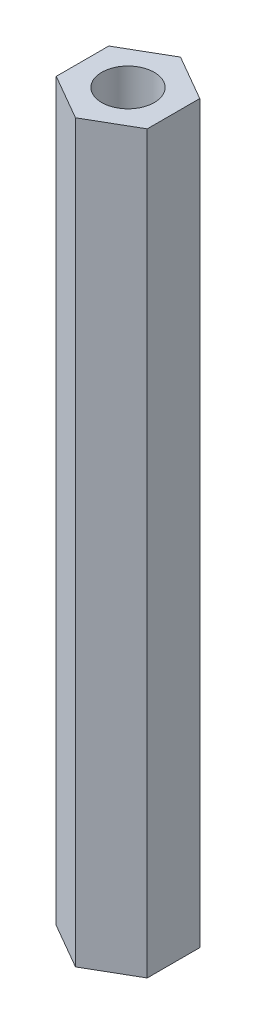
ISO-10303-21;
HEADER;
FILE_DESCRIPTION(('STEP AP214'),'2;1');
FILE_NAME('part.step','',(''),(''),'','','');
FILE_SCHEMA(('AUTOMOTIVE_DESIGN { 1 0 10303 214 1 1 1 1 }'));
ENDSEC;
DATA;
#1=APPLICATION_CONTEXT('core data for automotive mechanical design processes');
#2=APPLICATION_PROTOCOL_DEFINITION('international standard','automotive_design',2000,#1);
#3=PRODUCT_CONTEXT('',#1,'mechanical');
#4=PRODUCT('Part','Part','',(#3));
#5=PRODUCT_RELATED_PRODUCT_CATEGORY('part','',(#4));
#6=PRODUCT_DEFINITION_FORMATION('','',#4);
#7=PRODUCT_DEFINITION_CONTEXT('part definition',#1,'design');
#8=PRODUCT_DEFINITION('design','',#6,#7);
#9=PRODUCT_DEFINITION_SHAPE('','',#8);
#10=(LENGTH_UNIT() NAMED_UNIT(*) SI_UNIT(.MILLI.,.METRE.));
#11=(NAMED_UNIT(*) PLANE_ANGLE_UNIT() SI_UNIT($,.RADIAN.));
#12=(NAMED_UNIT(*) SI_UNIT($,.STERADIAN.) SOLID_ANGLE_UNIT());
#13=UNCERTAINTY_MEASURE_WITH_UNIT(LENGTH_MEASURE(1.E-05),#10,'distance_accuracy_value','');
#14=(GEOMETRIC_REPRESENTATION_CONTEXT(3) GLOBAL_UNCERTAINTY_ASSIGNED_CONTEXT((#13)) GLOBAL_UNIT_ASSIGNED_CONTEXT((#10,
#11,#12)) REPRESENTATION_CONTEXT('',''));
#15=CARTESIAN_POINT('',(0.,0.,0.));
#16=DIRECTION('',(0.,0.,1.));
#17=DIRECTION('',(1.,0.,0.));
#18=AXIS2_PLACEMENT_3D('',#15,#16,#17);
#19=CARTESIAN_POINT('',(0.,70.,-5.));
#20=DIRECTION('',(0.,1.,0.));
#21=DIRECTION('',(0.,0.,1.));
#22=AXIS2_PLACEMENT_3D('',#19,#20,#21);
#23=PLANE('',#22);
#24=DIRECTION('',(-0.866025403784439,0.,-0.5));
#25=VECTOR('',#24,1.);
#26=CARTESIAN_POINT('',(4.33012701892219,70.,-2.5));
#27=LINE('',#26,#25);
#28=CARTESIAN_POINT('',(4.33012701892219,70.,-2.5));
#29=VERTEX_POINT('',#28);
#30=CARTESIAN_POINT('',(0.,70.,-5.));
#31=VERTEX_POINT('',#30);
#32=EDGE_CURVE('E129',#29,#31,#27,.T.);
#33=ORIENTED_EDGE('',*,*,#32,.T.);
#34=DIRECTION('',(-0.866025403784439,0.,0.5));
#35=VECTOR('',#34,1.);
#36=CARTESIAN_POINT('',(0.,70.,-5.));
#37=LINE('',#36,#35);
#38=CARTESIAN_POINT('',(-4.33012701892219,70.,-2.5));
#39=VERTEX_POINT('',#38);
#40=EDGE_CURVE('E87',#31,#39,#37,.T.);
#41=ORIENTED_EDGE('',*,*,#40,.T.);
#42=DIRECTION('',(0.,0.,1.));
#43=VECTOR('',#42,1.);
#44=CARTESIAN_POINT('',(-4.33012701892219,70.,-2.5));
#45=LINE('',#44,#43);
#46=CARTESIAN_POINT('',(-4.33012701892219,70.,2.5));
#47=VERTEX_POINT('',#46);
#48=EDGE_CURVE('E100',#39,#47,#45,.T.);
#49=ORIENTED_EDGE('',*,*,#48,.T.);
#50=DIRECTION('',(0.866025403784439,0.,0.5));
#51=VECTOR('',#50,1.);
#52=CARTESIAN_POINT('',(-4.33012701892219,70.,2.5));
#53=LINE('',#52,#51);
#54=CARTESIAN_POINT('',(0.,70.,5.));
#55=VERTEX_POINT('',#54);
#56=EDGE_CURVE('E94',#47,#55,#53,.T.);
#57=ORIENTED_EDGE('',*,*,#56,.T.);
#58=DIRECTION('',(0.866025403784439,0.,-0.5));
#59=VECTOR('',#58,1.);
#60=CARTESIAN_POINT('',(0.,70.,5.));
#61=LINE('',#60,#59);
#62=CARTESIAN_POINT('',(4.33012701892219,70.,2.5));
#63=VERTEX_POINT('',#62);
#64=EDGE_CURVE('E98',#55,#63,#61,.T.);
#65=ORIENTED_EDGE('',*,*,#64,.T.);
#66=DIRECTION('',(0.,0.,-1.));
#67=VECTOR('',#66,1.);
#68=CARTESIAN_POINT('',(4.33012701892219,70.,2.5));
#69=LINE('',#68,#67);
#70=EDGE_CURVE('E50',#63,#29,#69,.T.);
#71=ORIENTED_EDGE('',*,*,#70,.T.);
#72=EDGE_LOOP('',(#33,#41,#49,#57,#65,#71));
#73=FACE_BOUND('',#72,.T.);
#74=CARTESIAN_POINT('',(0.,70.,0.));
#75=DIRECTION('',(0.,1.,0.));
#76=DIRECTION('',(0.,0.,1.));
#77=AXIS2_PLACEMENT_3D('',#74,#75,#76);
#78=CIRCLE('',#77,2.5);
#79=CARTESIAN_POINT('',(0.,70.,2.5));
#80=VERTEX_POINT('',#79);
#81=EDGE_CURVE('E122',#80,#80,#78,.T.);
#82=ORIENTED_EDGE('',*,*,#81,.F.);
#83=EDGE_LOOP('',(#82));
#84=FACE_BOUND('',#83,.T.);
#85=ADVANCED_FACE('F33',(#73,#84),#23,.T.);
#86=CARTESIAN_POINT('',(0.,0.,-5.));
#87=DIRECTION('',(0.,1.,0.));
#88=DIRECTION('',(0.,0.,1.));
#89=AXIS2_PLACEMENT_3D('',#86,#87,#88);
#90=PLANE('',#89);
#91=DIRECTION('',(-0.866025403784439,0.,-0.5));
#92=VECTOR('',#91,1.);
#93=CARTESIAN_POINT('',(4.33012701892219,0.,-2.5));
#94=LINE('',#93,#92);
#95=CARTESIAN_POINT('',(4.33012701892219,0.,-2.5));
#96=VERTEX_POINT('',#95);
#97=CARTESIAN_POINT('',(0.,0.,-5.));
#98=VERTEX_POINT('',#97);
#99=EDGE_CURVE('E118',#96,#98,#94,.T.);
#100=ORIENTED_EDGE('',*,*,#99,.F.);
#101=DIRECTION('',(0.,0.,-1.));
#102=VECTOR('',#101,1.);
#103=CARTESIAN_POINT('',(4.33012701892219,0.,2.5));
#104=LINE('',#103,#102);
#105=CARTESIAN_POINT('',(4.33012701892219,0.,2.5));
#106=VERTEX_POINT('',#105);
#107=EDGE_CURVE('E79',#106,#96,#104,.T.);
#108=ORIENTED_EDGE('',*,*,#107,.F.);
#109=DIRECTION('',(0.866025403784439,0.,-0.5));
#110=VECTOR('',#109,1.);
#111=CARTESIAN_POINT('',(0.,0.,5.));
#112=LINE('',#111,#110);
#113=CARTESIAN_POINT('',(0.,0.,5.));
#114=VERTEX_POINT('',#113);
#115=EDGE_CURVE('E73',#114,#106,#112,.T.);
#116=ORIENTED_EDGE('',*,*,#115,.F.);
#117=DIRECTION('',(0.866025403784439,0.,0.5));
#118=VECTOR('',#117,1.);
#119=CARTESIAN_POINT('',(-4.33012701892219,0.,2.5));
#120=LINE('',#119,#118);
#121=CARTESIAN_POINT('',(-4.33012701892219,0.,2.5));
#122=VERTEX_POINT('',#121);
#123=EDGE_CURVE('E108',#122,#114,#120,.T.);
#124=ORIENTED_EDGE('',*,*,#123,.F.);
#125=DIRECTION('',(0.,0.,1.));
#126=VECTOR('',#125,1.);
#127=CARTESIAN_POINT('',(-4.33012701892219,0.,-2.5));
#128=LINE('',#127,#126);
#129=CARTESIAN_POINT('',(-4.33012701892219,0.,-2.5));
#130=VERTEX_POINT('',#129);
#131=EDGE_CURVE('E124',#130,#122,#128,.T.);
#132=ORIENTED_EDGE('',*,*,#131,.F.);
#133=DIRECTION('',(-0.866025403784439,0.,0.5));
#134=VECTOR('',#133,1.);
#135=CARTESIAN_POINT('',(0.,0.,-5.));
#136=LINE('',#135,#134);
#137=EDGE_CURVE('E121',#98,#130,#136,.T.);
#138=ORIENTED_EDGE('',*,*,#137,.F.);
#139=EDGE_LOOP('',(#100,#108,#116,#124,#132,#138));
#140=FACE_BOUND('',#139,.T.);
#141=CARTESIAN_POINT('',(0.,0.,0.));
#142=DIRECTION('',(0.,1.,0.));
#143=DIRECTION('',(0.,0.,1.));
#144=AXIS2_PLACEMENT_3D('',#141,#142,#143);
#145=CIRCLE('',#144,2.5);
#146=CARTESIAN_POINT('',(0.,0.,2.5));
#147=VERTEX_POINT('',#146);
#148=EDGE_CURVE('E222',#147,#147,#145,.T.);
#149=ORIENTED_EDGE('',*,*,#148,.T.);
#150=EDGE_LOOP('',(#149));
#151=FACE_BOUND('',#150,.T.);
#152=ADVANCED_FACE('F138',(#140,#151),#90,.F.);
#153=CARTESIAN_POINT('',(4.33012701892219,70.,-2.5));
#154=DIRECTION('',(-0.5,0.,0.866025403784439));
#155=DIRECTION('',(0.866025403784439,0.,0.5));
#156=AXIS2_PLACEMENT_3D('',#153,#154,#155);
#157=PLANE('',#156);
#158=ORIENTED_EDGE('',*,*,#99,.T.);
#159=DIRECTION('',(0.,-1.,0.));
#160=VECTOR('',#159,1.);
#161=CARTESIAN_POINT('',(0.,70.,-5.));
#162=LINE('',#161,#160);
#163=EDGE_CURVE('E11',#31,#98,#162,.T.);
#164=ORIENTED_EDGE('',*,*,#163,.F.);
#165=ORIENTED_EDGE('',*,*,#32,.F.);
#166=DIRECTION('',(0.,-1.,0.));
#167=VECTOR('',#166,1.);
#168=CARTESIAN_POINT('',(4.33012701892219,70.,-2.5));
#169=LINE('',#168,#167);
#170=EDGE_CURVE('E114',#29,#96,#169,.T.);
#171=ORIENTED_EDGE('',*,*,#170,.T.);
#172=EDGE_LOOP('',(#158,#164,#165,#171));
#173=FACE_BOUND('',#172,.T.);
#174=ADVANCED_FACE('F35',(#173),#157,.F.);
#175=CARTESIAN_POINT('',(0.,70.,-5.));
#176=DIRECTION('',(0.5,0.,0.866025403784439));
#177=DIRECTION('',(0.866025403784439,0.,-0.5));
#178=AXIS2_PLACEMENT_3D('',#175,#176,#177);
#179=PLANE('',#178);
#180=ORIENTED_EDGE('',*,*,#137,.T.);
#181=DIRECTION('',(0.,-1.,0.));
#182=VECTOR('',#181,1.);
#183=CARTESIAN_POINT('',(-4.33012701892219,70.,-2.5));
#184=LINE('',#183,#182);
#185=EDGE_CURVE('E42',#39,#130,#184,.T.);
#186=ORIENTED_EDGE('',*,*,#185,.F.);
#187=ORIENTED_EDGE('',*,*,#40,.F.);
#188=ORIENTED_EDGE('',*,*,#163,.T.);
#189=EDGE_LOOP('',(#180,#186,#187,#188));
#190=FACE_BOUND('',#189,.T.);
#191=ADVANCED_FACE('F163',(#190),#179,.F.);
#192=CARTESIAN_POINT('',(-4.33012701892219,70.,-2.5));
#193=DIRECTION('',(1.,0.,0.));
#194=DIRECTION('',(0.,0.,-1.));
#195=AXIS2_PLACEMENT_3D('',#192,#193,#194);
#196=PLANE('',#195);
#197=ORIENTED_EDGE('',*,*,#131,.T.);
#198=DIRECTION('',(0.,-1.,0.));
#199=VECTOR('',#198,1.);
#200=CARTESIAN_POINT('',(-4.33012701892219,70.,2.5));
#201=LINE('',#200,#199);
#202=EDGE_CURVE('E109',#47,#122,#201,.T.);
#203=ORIENTED_EDGE('',*,*,#202,.F.);
#204=ORIENTED_EDGE('',*,*,#48,.F.);
#205=ORIENTED_EDGE('',*,*,#185,.T.);
#206=EDGE_LOOP('',(#197,#203,#204,#205));
#207=FACE_BOUND('',#206,.T.);
#208=ADVANCED_FACE('F135',(#207),#196,.F.);
#209=CARTESIAN_POINT('',(-4.33012701892219,70.,2.5));
#210=DIRECTION('',(0.5,0.,-0.866025403784439));
#211=DIRECTION('',(-0.866025403784439,0.,-0.5));
#212=AXIS2_PLACEMENT_3D('',#209,#210,#211);
#213=PLANE('',#212);
#214=ORIENTED_EDGE('',*,*,#123,.T.);
#215=DIRECTION('',(0.,-1.,0.));
#216=VECTOR('',#215,1.);
#217=CARTESIAN_POINT('',(0.,70.,5.));
#218=LINE('',#217,#216);
#219=EDGE_CURVE('E105',#55,#114,#218,.T.);
#220=ORIENTED_EDGE('',*,*,#219,.F.);
#221=ORIENTED_EDGE('',*,*,#56,.F.);
#222=ORIENTED_EDGE('',*,*,#202,.T.);
#223=EDGE_LOOP('',(#214,#220,#221,#222));
#224=FACE_BOUND('',#223,.T.);
#225=ADVANCED_FACE('F106',(#224),#213,.F.);
#226=CARTESIAN_POINT('',(0.,70.,5.));
#227=DIRECTION('',(-0.5,0.,-0.866025403784439));
#228=DIRECTION('',(-0.866025403784439,0.,0.5));
#229=AXIS2_PLACEMENT_3D('',#226,#227,#228);
#230=PLANE('',#229);
#231=ORIENTED_EDGE('',*,*,#115,.T.);
#232=DIRECTION('',(0.,-1.,0.));
#233=VECTOR('',#232,1.);
#234=CARTESIAN_POINT('',(4.33012701892219,70.,2.5));
#235=LINE('',#234,#233);
#236=EDGE_CURVE('E110',#63,#106,#235,.T.);
#237=ORIENTED_EDGE('',*,*,#236,.F.);
#238=ORIENTED_EDGE('',*,*,#64,.F.);
#239=ORIENTED_EDGE('',*,*,#219,.T.);
#240=EDGE_LOOP('',(#231,#237,#238,#239));
#241=FACE_BOUND('',#240,.T.);
#242=ADVANCED_FACE('F112',(#241),#230,.F.);
#243=CARTESIAN_POINT('',(4.33012701892219,70.,2.5));
#244=DIRECTION('',(-1.,0.,0.));
#245=DIRECTION('',(0.,0.,1.));
#246=AXIS2_PLACEMENT_3D('',#243,#244,#245);
#247=PLANE('',#246);
#248=ORIENTED_EDGE('',*,*,#107,.T.);
#249=ORIENTED_EDGE('',*,*,#170,.F.);
#250=ORIENTED_EDGE('',*,*,#70,.F.);
#251=ORIENTED_EDGE('',*,*,#236,.T.);
#252=EDGE_LOOP('',(#248,#249,#250,#251));
#253=FACE_BOUND('',#252,.T.);
#254=ADVANCED_FACE('F143',(#253),#247,.F.);
#255=CARTESIAN_POINT('',(0.,70.,0.));
#256=DIRECTION('',(0.,-1.,0.));
#257=DIRECTION('',(0.,0.,-1.));
#258=AXIS2_PLACEMENT_3D('',#255,#256,#257);
#259=CYLINDRICAL_SURFACE('',#258,2.5);
#260=ORIENTED_EDGE('',*,*,#81,.T.);
#261=EDGE_LOOP('',(#260));
#262=FACE_BOUND('',#261,.T.);
#263=ORIENTED_EDGE('',*,*,#148,.F.);
#264=EDGE_LOOP('',(#263));
#265=FACE_BOUND('',#264,.T.);
#266=ADVANCED_FACE('F145',(#262,#265),#259,.F.);
#267=CLOSED_SHELL('',(#85,#152,#174,#191,#208,#225,#242,#254,#266));
#268=MANIFOLD_SOLID_BREP('B2',#267);
#269=ADVANCED_BREP_SHAPE_REPRESENTATION('',(#18,#268),#14);
#270=SHAPE_DEFINITION_REPRESENTATION(#9,#269);
ENDSEC;
END-ISO-10303-21;
